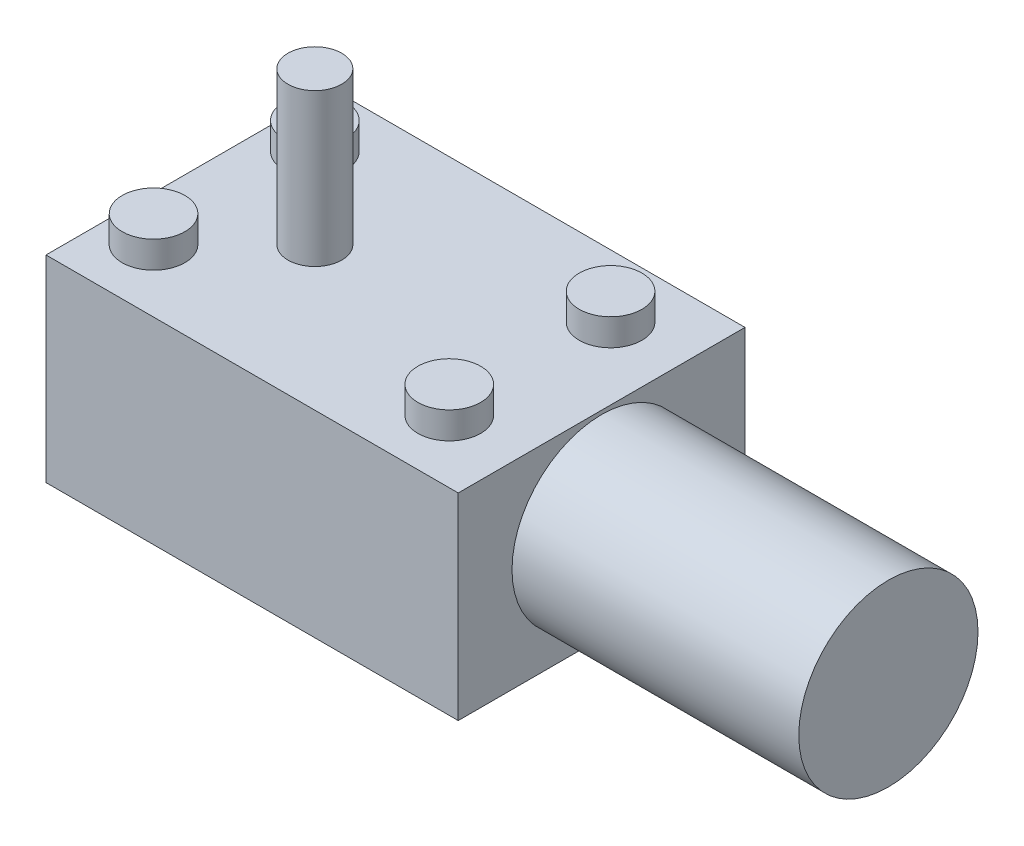
ISO-10303-21;
HEADER;
FILE_DESCRIPTION(('STEP AP214'),'2;1');
FILE_NAME('part.step','',(''),(''),'','','');
FILE_SCHEMA(('AUTOMOTIVE_DESIGN { 1 0 10303 214 1 1 1 1 }'));
ENDSEC;
DATA;
#1=APPLICATION_CONTEXT('core data for automotive mechanical design processes');
#2=APPLICATION_PROTOCOL_DEFINITION('international standard','automotive_design',2000,#1);
#3=PRODUCT_CONTEXT('',#1,'mechanical');
#4=PRODUCT('Part','Part','',(#3));
#5=PRODUCT_RELATED_PRODUCT_CATEGORY('part','',(#4));
#6=PRODUCT_DEFINITION_FORMATION('','',#4);
#7=PRODUCT_DEFINITION_CONTEXT('part definition',#1,'design');
#8=PRODUCT_DEFINITION('design','',#6,#7);
#9=PRODUCT_DEFINITION_SHAPE('','',#8);
#10=(LENGTH_UNIT() NAMED_UNIT(*) SI_UNIT(.MILLI.,.METRE.));
#11=(NAMED_UNIT(*) PLANE_ANGLE_UNIT() SI_UNIT($,.RADIAN.));
#12=(NAMED_UNIT(*) SI_UNIT($,.STERADIAN.) SOLID_ANGLE_UNIT());
#13=UNCERTAINTY_MEASURE_WITH_UNIT(LENGTH_MEASURE(1.E-05),#10,'distance_accuracy_value','');
#14=(GEOMETRIC_REPRESENTATION_CONTEXT(3) GLOBAL_UNCERTAINTY_ASSIGNED_CONTEXT((#13)) GLOBAL_UNIT_ASSIGNED_CONTEXT((#10,
#11,#12)) REPRESENTATION_CONTEXT('',''));
#15=CARTESIAN_POINT('',(0.,0.,0.));
#16=DIRECTION('',(0.,0.,1.));
#17=DIRECTION('',(1.,0.,0.));
#18=AXIS2_PLACEMENT_3D('',#15,#16,#17);
#19=CARTESIAN_POINT('',(0.,22.,0.));
#20=DIRECTION('',(0.,1.,0.));
#21=DIRECTION('',(0.,0.,1.));
#22=AXIS2_PLACEMENT_3D('',#19,#20,#21);
#23=PLANE('',#22);
#24=CARTESIAN_POINT('',(15.,22.,-9.));
#25=DIRECTION('',(0.,1.,0.));
#26=DIRECTION('',(0.,0.,1.));
#27=AXIS2_PLACEMENT_3D('',#24,#25,#26);
#28=CIRCLE('',#27,3.5);
#29=CARTESIAN_POINT('',(15.,22.,-5.5));
#30=VERTEX_POINT('',#29);
#31=EDGE_CURVE('E138',#30,#30,#28,.T.);
#32=ORIENTED_EDGE('',*,*,#31,.F.);
#33=EDGE_LOOP('',(#32));
#34=FACE_BOUND('',#33,.T.);
#35=CARTESIAN_POINT('',(-18.,22.,9.));
#36=DIRECTION('',(0.,1.,0.));
#37=DIRECTION('',(0.,0.,1.));
#38=AXIS2_PLACEMENT_3D('',#35,#36,#37);
#39=CIRCLE('',#38,3.5);
#40=CARTESIAN_POINT('',(-18.,22.,12.5));
#41=VERTEX_POINT('',#40);
#42=EDGE_CURVE('E50',#41,#41,#39,.T.);
#43=ORIENTED_EDGE('',*,*,#42,.F.);
#44=EDGE_LOOP('',(#43));
#45=FACE_BOUND('',#44,.T.);
#46=CARTESIAN_POINT('',(-9.,22.,0.));
#47=DIRECTION('',(0.,1.,0.));
#48=DIRECTION('',(0.,0.,1.));
#49=AXIS2_PLACEMENT_3D('',#46,#47,#48);
#50=CIRCLE('',#49,3.);
#51=CARTESIAN_POINT('',(-9.,22.,3.));
#52=VERTEX_POINT('',#51);
#53=EDGE_CURVE('E130',#52,#52,#50,.T.);
#54=ORIENTED_EDGE('',*,*,#53,.F.);
#55=EDGE_LOOP('',(#54));
#56=FACE_BOUND('',#55,.T.);
#57=DIRECTION('',(0.,0.,-1.));
#58=VECTOR('',#57,1.);
#59=CARTESIAN_POINT('',(23.,22.,-16.));
#60=LINE('',#59,#58);
#61=CARTESIAN_POINT('',(23.,22.,16.));
#62=VERTEX_POINT('',#61);
#63=CARTESIAN_POINT('',(23.,22.,-16.));
#64=VERTEX_POINT('',#63);
#65=EDGE_CURVE('E94',#62,#64,#60,.T.);
#66=ORIENTED_EDGE('',*,*,#65,.T.);
#67=DIRECTION('',(-1.,0.,0.));
#68=VECTOR('',#67,1.);
#69=CARTESIAN_POINT('',(-23.,22.,-16.));
#70=LINE('',#69,#68);
#71=CARTESIAN_POINT('',(-23.,22.,-16.));
#72=VERTEX_POINT('',#71);
#73=EDGE_CURVE('E89',#64,#72,#70,.T.);
#74=ORIENTED_EDGE('',*,*,#73,.T.);
#75=DIRECTION('',(0.,0.,1.));
#76=VECTOR('',#75,1.);
#77=CARTESIAN_POINT('',(-23.,22.,-16.));
#78=LINE('',#77,#76);
#79=CARTESIAN_POINT('',(-23.,22.,16.));
#80=VERTEX_POINT('',#79);
#81=EDGE_CURVE('E92',#72,#80,#78,.T.);
#82=ORIENTED_EDGE('',*,*,#81,.T.);
#83=DIRECTION('',(1.,0.,0.));
#84=VECTOR('',#83,1.);
#85=CARTESIAN_POINT('',(-23.,22.,16.));
#86=LINE('',#85,#84);
#87=EDGE_CURVE('E58',#80,#62,#86,.T.);
#88=ORIENTED_EDGE('',*,*,#87,.T.);
#89=EDGE_LOOP('',(#66,#74,#82,#88));
#90=FACE_BOUND('',#89,.T.);
#91=CARTESIAN_POINT('',(15.,22.,9.));
#92=DIRECTION('',(0.,1.,0.));
#93=DIRECTION('',(0.,0.,1.));
#94=AXIS2_PLACEMENT_3D('',#91,#92,#93);
#95=CIRCLE('',#94,3.5);
#96=CARTESIAN_POINT('',(15.,22.,12.5));
#97=VERTEX_POINT('',#96);
#98=EDGE_CURVE('E11',#97,#97,#95,.T.);
#99=ORIENTED_EDGE('',*,*,#98,.F.);
#100=EDGE_LOOP('',(#99));
#101=FACE_BOUND('',#100,.T.);
#102=CARTESIAN_POINT('',(-18.,22.,-9.));
#103=DIRECTION('',(0.,1.,0.));
#104=DIRECTION('',(0.,0.,1.));
#105=AXIS2_PLACEMENT_3D('',#102,#103,#104);
#106=CIRCLE('',#105,3.5);
#107=CARTESIAN_POINT('',(-18.,22.,-5.5));
#108=VERTEX_POINT('',#107);
#109=EDGE_CURVE('E142',#108,#108,#106,.T.);
#110=ORIENTED_EDGE('',*,*,#109,.F.);
#111=EDGE_LOOP('',(#110));
#112=FACE_BOUND('',#111,.T.);
#113=ADVANCED_FACE('F41',(#34,#45,#56,#90,#101,#112),#23,.T.);
#114=CARTESIAN_POINT('',(23.,22.,-16.));
#115=DIRECTION('',(-1.,0.,0.));
#116=DIRECTION('',(0.,0.,1.));
#117=AXIS2_PLACEMENT_3D('',#114,#115,#116);
#118=PLANE('',#117);
#119=CARTESIAN_POINT('',(23.,11.5777475095,0.));
#120=DIRECTION('',(1.,0.,0.));
#121=DIRECTION('',(0.,0.,-1.));
#122=AXIS2_PLACEMENT_3D('',#119,#120,#121);
#123=CIRCLE('',#122,10.);
#124=CARTESIAN_POINT('',(23.,11.5777475095,-10.));
#125=VERTEX_POINT('',#124);
#126=EDGE_CURVE('E118',#125,#125,#123,.T.);
#127=ORIENTED_EDGE('',*,*,#126,.F.);
#128=EDGE_LOOP('',(#127));
#129=FACE_BOUND('',#128,.T.);
#130=DIRECTION('',(0.,0.,-1.));
#131=VECTOR('',#130,1.);
#132=CARTESIAN_POINT('',(23.,0.,-16.));
#133=LINE('',#132,#131);
#134=CARTESIAN_POINT('',(23.,0.,16.));
#135=VERTEX_POINT('',#134);
#136=CARTESIAN_POINT('',(23.,0.,-16.));
#137=VERTEX_POINT('',#136);
#138=EDGE_CURVE('E109',#135,#137,#133,.T.);
#139=ORIENTED_EDGE('',*,*,#138,.T.);
#140=DIRECTION('',(0.,-1.,0.));
#141=VECTOR('',#140,1.);
#142=CARTESIAN_POINT('',(23.,22.,-16.));
#143=LINE('',#142,#141);
#144=EDGE_CURVE('E100',#64,#137,#143,.T.);
#145=ORIENTED_EDGE('',*,*,#144,.F.);
#146=ORIENTED_EDGE('',*,*,#65,.F.);
#147=DIRECTION('',(0.,-1.,0.));
#148=VECTOR('',#147,1.);
#149=CARTESIAN_POINT('',(23.,22.,16.));
#150=LINE('',#149,#148);
#151=EDGE_CURVE('E105',#62,#135,#150,.T.);
#152=ORIENTED_EDGE('',*,*,#151,.T.);
#153=EDGE_LOOP('',(#139,#145,#146,#152));
#154=FACE_BOUND('',#153,.T.);
#155=ADVANCED_FACE('F43',(#129,#154),#118,.F.);
#156=CARTESIAN_POINT('',(-23.,22.,-16.));
#157=DIRECTION('',(0.,0.,1.));
#158=DIRECTION('',(1.,0.,0.));
#159=AXIS2_PLACEMENT_3D('',#156,#157,#158);
#160=PLANE('',#159);
#161=DIRECTION('',(-1.,0.,0.));
#162=VECTOR('',#161,1.);
#163=CARTESIAN_POINT('',(-23.,0.,-16.));
#164=LINE('',#163,#162);
#165=CARTESIAN_POINT('',(-23.,0.,-16.));
#166=VERTEX_POINT('',#165);
#167=EDGE_CURVE('E99',#137,#166,#164,.T.);
#168=ORIENTED_EDGE('',*,*,#167,.T.);
#169=DIRECTION('',(0.,-1.,0.));
#170=VECTOR('',#169,1.);
#171=CARTESIAN_POINT('',(-23.,22.,-16.));
#172=LINE('',#171,#170);
#173=EDGE_CURVE('E97',#72,#166,#172,.T.);
#174=ORIENTED_EDGE('',*,*,#173,.F.);
#175=ORIENTED_EDGE('',*,*,#73,.F.);
#176=ORIENTED_EDGE('',*,*,#144,.T.);
#177=EDGE_LOOP('',(#168,#174,#175,#176));
#178=FACE_BOUND('',#177,.T.);
#179=ADVANCED_FACE('F98',(#178),#160,.F.);
#180=CARTESIAN_POINT('',(-23.,22.,-16.));
#181=DIRECTION('',(1.,0.,0.));
#182=DIRECTION('',(0.,0.,-1.));
#183=AXIS2_PLACEMENT_3D('',#180,#181,#182);
#184=PLANE('',#183);
#185=DIRECTION('',(0.,0.,1.));
#186=VECTOR('',#185,1.);
#187=CARTESIAN_POINT('',(-23.,0.,-16.));
#188=LINE('',#187,#186);
#189=CARTESIAN_POINT('',(-23.,0.,16.));
#190=VERTEX_POINT('',#189);
#191=EDGE_CURVE('E75',#166,#190,#188,.T.);
#192=ORIENTED_EDGE('',*,*,#191,.T.);
#193=DIRECTION('',(0.,-1.,0.));
#194=VECTOR('',#193,1.);
#195=CARTESIAN_POINT('',(-23.,22.,16.));
#196=LINE('',#195,#194);
#197=EDGE_CURVE('E101',#80,#190,#196,.T.);
#198=ORIENTED_EDGE('',*,*,#197,.F.);
#199=ORIENTED_EDGE('',*,*,#81,.F.);
#200=ORIENTED_EDGE('',*,*,#173,.T.);
#201=EDGE_LOOP('',(#192,#198,#199,#200));
#202=FACE_BOUND('',#201,.T.);
#203=ADVANCED_FACE('F103',(#202),#184,.F.);
#204=CARTESIAN_POINT('',(-23.,22.,16.));
#205=DIRECTION('',(0.,0.,-1.));
#206=DIRECTION('',(-1.,0.,0.));
#207=AXIS2_PLACEMENT_3D('',#204,#205,#206);
#208=PLANE('',#207);
#209=DIRECTION('',(1.,0.,0.));
#210=VECTOR('',#209,1.);
#211=CARTESIAN_POINT('',(-23.,0.,16.));
#212=LINE('',#211,#210);
#213=EDGE_CURVE('E81',#190,#135,#212,.T.);
#214=ORIENTED_EDGE('',*,*,#213,.T.);
#215=ORIENTED_EDGE('',*,*,#151,.F.);
#216=ORIENTED_EDGE('',*,*,#87,.F.);
#217=ORIENTED_EDGE('',*,*,#197,.T.);
#218=EDGE_LOOP('',(#214,#215,#216,#217));
#219=FACE_BOUND('',#218,.T.);
#220=ADVANCED_FACE('F187',(#219),#208,.F.);
#221=CARTESIAN_POINT('',(0.,0.,0.));
#222=DIRECTION('',(0.,1.,0.));
#223=DIRECTION('',(0.,0.,1.));
#224=AXIS2_PLACEMENT_3D('',#221,#222,#223);
#225=PLANE('',#224);
#226=ORIENTED_EDGE('',*,*,#138,.F.);
#227=ORIENTED_EDGE('',*,*,#213,.F.);
#228=ORIENTED_EDGE('',*,*,#191,.F.);
#229=ORIENTED_EDGE('',*,*,#167,.F.);
#230=EDGE_LOOP('',(#226,#227,#228,#229));
#231=FACE_BOUND('',#230,.T.);
#232=ADVANCED_FACE('F182',(#231),#225,.F.);
#233=CARTESIAN_POINT('',(55.,11.5777475095,0.));
#234=DIRECTION('',(-1.,0.,0.));
#235=DIRECTION('',(0.,0.,1.));
#236=AXIS2_PLACEMENT_3D('',#233,#234,#235);
#237=CYLINDRICAL_SURFACE('',#236,10.);
#238=CARTESIAN_POINT('',(55.,11.5777475095,0.));
#239=DIRECTION('',(1.,0.,0.));
#240=DIRECTION('',(0.,0.,-1.));
#241=AXIS2_PLACEMENT_3D('',#238,#239,#240);
#242=CIRCLE('',#241,10.);
#243=CARTESIAN_POINT('',(55.,11.5777475095,-10.));
#244=VERTEX_POINT('',#243);
#245=EDGE_CURVE('E112',#244,#244,#242,.T.);
#246=ORIENTED_EDGE('',*,*,#245,.F.);
#247=EDGE_LOOP('',(#246));
#248=FACE_BOUND('',#247,.T.);
#249=ORIENTED_EDGE('',*,*,#126,.T.);
#250=EDGE_LOOP('',(#249));
#251=FACE_BOUND('',#250,.T.);
#252=ADVANCED_FACE('F175',(#248,#251),#237,.T.);
#253=CARTESIAN_POINT('',(55.,11.5777475095,0.));
#254=DIRECTION('',(1.,0.,0.));
#255=DIRECTION('',(0.,0.,-1.));
#256=AXIS2_PLACEMENT_3D('',#253,#254,#255);
#257=PLANE('',#256);
#258=ORIENTED_EDGE('',*,*,#245,.T.);
#259=EDGE_LOOP('',(#258));
#260=FACE_BOUND('',#259,.T.);
#261=ADVANCED_FACE('F165',(#260),#257,.T.);
#262=CARTESIAN_POINT('',(-9.,39.,0.));
#263=DIRECTION('',(0.,-1.,0.));
#264=DIRECTION('',(0.,0.,-1.));
#265=AXIS2_PLACEMENT_3D('',#262,#263,#264);
#266=CYLINDRICAL_SURFACE('',#265,3.);
#267=CARTESIAN_POINT('',(-9.,39.,0.));
#268=DIRECTION('',(0.,1.,0.));
#269=DIRECTION('',(0.,0.,1.));
#270=AXIS2_PLACEMENT_3D('',#267,#268,#269);
#271=CIRCLE('',#270,3.);
#272=CARTESIAN_POINT('',(-9.,39.,3.));
#273=VERTEX_POINT('',#272);
#274=EDGE_CURVE('E129',#273,#273,#271,.T.);
#275=ORIENTED_EDGE('',*,*,#274,.F.);
#276=EDGE_LOOP('',(#275));
#277=FACE_BOUND('',#276,.T.);
#278=ORIENTED_EDGE('',*,*,#53,.T.);
#279=EDGE_LOOP('',(#278));
#280=FACE_BOUND('',#279,.T.);
#281=ADVANCED_FACE('F162',(#277,#280),#266,.T.);
#282=CARTESIAN_POINT('',(0.,39.,0.));
#283=DIRECTION('',(0.,1.,0.));
#284=DIRECTION('',(0.,0.,1.));
#285=AXIS2_PLACEMENT_3D('',#282,#283,#284);
#286=PLANE('',#285);
#287=ORIENTED_EDGE('',*,*,#274,.T.);
#288=EDGE_LOOP('',(#287));
#289=FACE_BOUND('',#288,.T.);
#290=ADVANCED_FACE('F164',(#289),#286,.T.);
#291=CARTESIAN_POINT('',(-18.,25.,9.));
#292=DIRECTION('',(0.,-1.,0.));
#293=DIRECTION('',(0.,0.,-1.));
#294=AXIS2_PLACEMENT_3D('',#291,#292,#293);
#295=CYLINDRICAL_SURFACE('',#294,3.5);
#296=CARTESIAN_POINT('',(-18.,25.,9.));
#297=DIRECTION('',(0.,1.,0.));
#298=DIRECTION('',(0.,0.,1.));
#299=AXIS2_PLACEMENT_3D('',#296,#297,#298);
#300=CIRCLE('',#299,3.5);
#301=CARTESIAN_POINT('',(-18.,25.,12.5));
#302=VERTEX_POINT('',#301);
#303=EDGE_CURVE('E133',#302,#302,#300,.F.);
#304=ORIENTED_EDGE('',*,*,#303,.T.);
#305=EDGE_LOOP('',(#304));
#306=FACE_BOUND('',#305,.T.);
#307=ORIENTED_EDGE('',*,*,#42,.T.);
#308=EDGE_LOOP('',(#307));
#309=FACE_BOUND('',#308,.T.);
#310=ADVANCED_FACE('F172',(#306,#309),#295,.T.);
#311=CARTESIAN_POINT('',(0.,25.,0.));
#312=DIRECTION('',(0.,1.,0.));
#313=DIRECTION('',(0.,0.,1.));
#314=AXIS2_PLACEMENT_3D('',#311,#312,#313);
#315=PLANE('',#314);
#316=ORIENTED_EDGE('',*,*,#303,.F.);
#317=EDGE_LOOP('',(#316));
#318=FACE_BOUND('',#317,.T.);
#319=ADVANCED_FACE('F242',(#318),#315,.T.);
#320=CARTESIAN_POINT('',(15.,25.,-9.));
#321=DIRECTION('',(0.,-1.,0.));
#322=DIRECTION('',(0.,0.,-1.));
#323=AXIS2_PLACEMENT_3D('',#320,#321,#322);
#324=CYLINDRICAL_SURFACE('',#323,3.5);
#325=CARTESIAN_POINT('',(15.,25.,-9.));
#326=DIRECTION('',(0.,1.,0.));
#327=DIRECTION('',(0.,0.,1.));
#328=AXIS2_PLACEMENT_3D('',#325,#326,#327);
#329=CIRCLE('',#328,3.5);
#330=CARTESIAN_POINT('',(15.,25.,-5.5));
#331=VERTEX_POINT('',#330);
#332=EDGE_CURVE('E148',#331,#331,#329,.T.);
#333=ORIENTED_EDGE('',*,*,#332,.F.);
#334=EDGE_LOOP('',(#333));
#335=FACE_BOUND('',#334,.T.);
#336=ORIENTED_EDGE('',*,*,#31,.T.);
#337=EDGE_LOOP('',(#336));
#338=FACE_BOUND('',#337,.T.);
#339=ADVANCED_FACE('F154',(#335,#338),#324,.T.);
#340=CARTESIAN_POINT('',(0.,25.,0.));
#341=DIRECTION('',(0.,1.,0.));
#342=DIRECTION('',(0.,0.,1.));
#343=AXIS2_PLACEMENT_3D('',#340,#341,#342);
#344=PLANE('',#343);
#345=ORIENTED_EDGE('',*,*,#332,.T.);
#346=EDGE_LOOP('',(#345));
#347=FACE_BOUND('',#346,.T.);
#348=ADVANCED_FACE('F260',(#347),#344,.T.);
#349=CARTESIAN_POINT('',(15.,25.,9.));
#350=DIRECTION('',(0.,-1.,0.));
#351=DIRECTION('',(0.,0.,-1.));
#352=AXIS2_PLACEMENT_3D('',#349,#350,#351);
#353=CYLINDRICAL_SURFACE('',#352,3.5);
#354=CARTESIAN_POINT('',(15.,25.,9.));
#355=DIRECTION('',(0.,1.,0.));
#356=DIRECTION('',(0.,0.,1.));
#357=AXIS2_PLACEMENT_3D('',#354,#355,#356);
#358=CIRCLE('',#357,3.5);
#359=CARTESIAN_POINT('',(15.,25.,12.5));
#360=VERTEX_POINT('',#359);
#361=EDGE_CURVE('E145',#360,#360,#358,.F.);
#362=ORIENTED_EDGE('',*,*,#361,.T.);
#363=EDGE_LOOP('',(#362));
#364=FACE_BOUND('',#363,.T.);
#365=ORIENTED_EDGE('',*,*,#98,.T.);
#366=EDGE_LOOP('',(#365));
#367=FACE_BOUND('',#366,.T.);
#368=ADVANCED_FACE('F270',(#364,#367),#353,.T.);
#369=CARTESIAN_POINT('',(0.,25.,0.));
#370=DIRECTION('',(0.,1.,0.));
#371=DIRECTION('',(0.,0.,1.));
#372=AXIS2_PLACEMENT_3D('',#369,#370,#371);
#373=PLANE('',#372);
#374=ORIENTED_EDGE('',*,*,#361,.F.);
#375=EDGE_LOOP('',(#374));
#376=FACE_BOUND('',#375,.T.);
#377=ADVANCED_FACE('F280',(#376),#373,.T.);
#378=CARTESIAN_POINT('',(-18.,25.,-9.));
#379=DIRECTION('',(0.,-1.,0.));
#380=DIRECTION('',(0.,0.,-1.));
#381=AXIS2_PLACEMENT_3D('',#378,#379,#380);
#382=CYLINDRICAL_SURFACE('',#381,3.5);
#383=CARTESIAN_POINT('',(-18.,25.,-9.));
#384=DIRECTION('',(0.,1.,0.));
#385=DIRECTION('',(0.,0.,1.));
#386=AXIS2_PLACEMENT_3D('',#383,#384,#385);
#387=CIRCLE('',#386,3.5);
#388=CARTESIAN_POINT('',(-18.,25.,-5.5));
#389=VERTEX_POINT('',#388);
#390=EDGE_CURVE('E139',#389,#389,#387,.T.);
#391=ORIENTED_EDGE('',*,*,#390,.F.);
#392=EDGE_LOOP('',(#391));
#393=FACE_BOUND('',#392,.T.);
#394=ORIENTED_EDGE('',*,*,#109,.T.);
#395=EDGE_LOOP('',(#394));
#396=FACE_BOUND('',#395,.T.);
#397=ADVANCED_FACE('F290',(#393,#396),#382,.T.);
#398=CARTESIAN_POINT('',(-18.,25.,-9.));
#399=DIRECTION('',(0.,1.,0.));
#400=DIRECTION('',(0.,0.,1.));
#401=AXIS2_PLACEMENT_3D('',#398,#399,#400);
#402=PLANE('',#401);
#403=ORIENTED_EDGE('',*,*,#390,.T.);
#404=EDGE_LOOP('',(#403));
#405=FACE_BOUND('',#404,.T.);
#406=ADVANCED_FACE('F300',(#405),#402,.T.);
#407=CLOSED_SHELL('',(#113,#155,#179,#203,#220,#232,#252,#261,#281,#290,#310,#319,#339,#348,
#368,#377,#397,#406));
#408=MANIFOLD_SOLID_BREP('B2',#407);
#409=ADVANCED_BREP_SHAPE_REPRESENTATION('',(#18,#408),#14);
#410=SHAPE_DEFINITION_REPRESENTATION(#9,#409);
ENDSEC;
END-ISO-10303-21;
